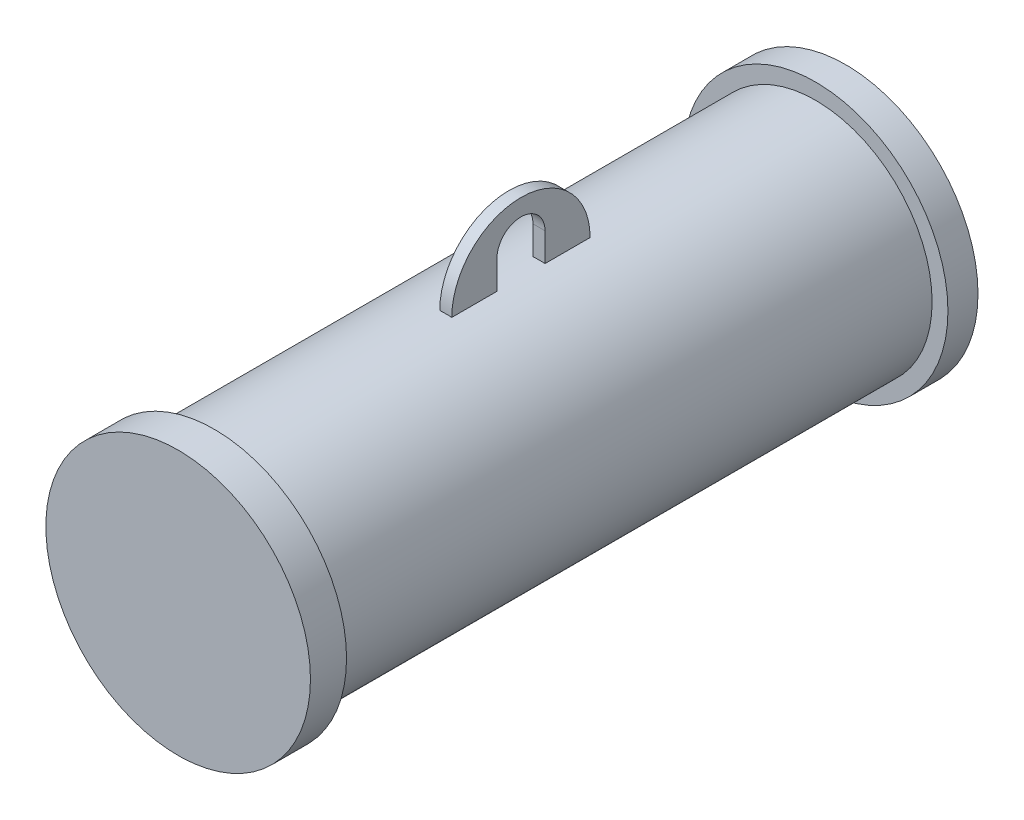
ISO-10303-21;
HEADER;
FILE_DESCRIPTION(('STEP AP214'),'2;1');
FILE_NAME('part.step','',(''),(''),'','','');
FILE_SCHEMA(('AUTOMOTIVE_DESIGN { 1 0 10303 214 1 1 1 1 }'));
ENDSEC;
DATA;
#1=APPLICATION_CONTEXT('core data for automotive mechanical design processes');
#2=APPLICATION_PROTOCOL_DEFINITION('international standard','automotive_design',2000,#1);
#3=PRODUCT_CONTEXT('',#1,'mechanical');
#4=PRODUCT('Part','Part','',(#3));
#5=PRODUCT_RELATED_PRODUCT_CATEGORY('part','',(#4));
#6=PRODUCT_DEFINITION_FORMATION('','',#4);
#7=PRODUCT_DEFINITION_CONTEXT('part definition',#1,'design');
#8=PRODUCT_DEFINITION('design','',#6,#7);
#9=PRODUCT_DEFINITION_SHAPE('','',#8);
#10=(LENGTH_UNIT() NAMED_UNIT(*) SI_UNIT(.MILLI.,.METRE.));
#11=(NAMED_UNIT(*) PLANE_ANGLE_UNIT() SI_UNIT($,.RADIAN.));
#12=(NAMED_UNIT(*) SI_UNIT($,.STERADIAN.) SOLID_ANGLE_UNIT());
#13=UNCERTAINTY_MEASURE_WITH_UNIT(LENGTH_MEASURE(1.E-05),#10,'distance_accuracy_value','');
#14=(GEOMETRIC_REPRESENTATION_CONTEXT(3) GLOBAL_UNCERTAINTY_ASSIGNED_CONTEXT((#13)) GLOBAL_UNIT_ASSIGNED_CONTEXT((#10,
#11,#12)) REPRESENTATION_CONTEXT('',''));
#15=CARTESIAN_POINT('',(0.,0.,0.));
#16=DIRECTION('',(0.,0.,1.));
#17=DIRECTION('',(1.,0.,0.));
#18=AXIS2_PLACEMENT_3D('',#15,#16,#17);
#19=CARTESIAN_POINT('',(0.,0.,0.));
#20=DIRECTION('',(0.,0.,1.));
#21=DIRECTION('',(1.,0.,0.));
#22=AXIS2_PLACEMENT_3D('',#19,#20,#21);
#23=PLANE('',#22);
#24=CARTESIAN_POINT('',(0.,0.,0.));
#25=DIRECTION('',(0.,0.,1.));
#26=DIRECTION('',(1.,0.,0.));
#27=AXIS2_PLACEMENT_3D('',#24,#25,#26);
#28=CIRCLE('',#27,110.);
#29=CARTESIAN_POINT('',(110.,0.,0.));
#30=VERTEX_POINT('',#29);
#31=EDGE_CURVE('E20',#30,#30,#28,.T.);
#32=ORIENTED_EDGE('',*,*,#31,.T.);
#33=EDGE_LOOP('',(#32));
#34=FACE_BOUND('',#33,.T.);
#35=ADVANCED_FACE('F16',(#34),#23,.T.);
#36=CARTESIAN_POINT('',(0.,0.,-30.));
#37=DIRECTION('',(0.,0.,1.));
#38=DIRECTION('',(1.,0.,0.));
#39=AXIS2_PLACEMENT_3D('',#36,#37,#38);
#40=CYLINDRICAL_SURFACE('',#39,110.);
#41=CARTESIAN_POINT('',(0.,0.,-30.));
#42=DIRECTION('',(0.,0.,1.));
#43=DIRECTION('',(1.,0.,0.));
#44=AXIS2_PLACEMENT_3D('',#41,#42,#43);
#45=CIRCLE('',#44,110.);
#46=CARTESIAN_POINT('',(110.,0.,-30.));
#47=VERTEX_POINT('',#46);
#48=EDGE_CURVE('E10',#47,#47,#45,.T.);
#49=ORIENTED_EDGE('',*,*,#48,.T.);
#50=EDGE_LOOP('',(#49));
#51=FACE_BOUND('',#50,.T.);
#52=ORIENTED_EDGE('',*,*,#31,.F.);
#53=EDGE_LOOP('',(#52));
#54=FACE_BOUND('',#53,.T.);
#55=ADVANCED_FACE('F18',(#51,#54),#40,.T.);
#56=CARTESIAN_POINT('',(0.,0.,-30.));
#57=DIRECTION('',(0.,0.,1.));
#58=DIRECTION('',(1.,0.,0.));
#59=AXIS2_PLACEMENT_3D('',#56,#57,#58);
#60=PLANE('',#59);
#61=CARTESIAN_POINT('',(0.,0.,-30.));
#62=DIRECTION('',(0.,0.,1.));
#63=DIRECTION('',(1.,0.,0.));
#64=AXIS2_PLACEMENT_3D('',#61,#62,#63);
#65=CIRCLE('',#64,96.85);
#66=CARTESIAN_POINT('',(96.85,0.,-30.));
#67=VERTEX_POINT('',#66);
#68=EDGE_CURVE('E166',#67,#67,#65,.T.);
#69=ORIENTED_EDGE('',*,*,#68,.T.);
#70=EDGE_LOOP('',(#69));
#71=FACE_BOUND('',#70,.T.);
#72=ORIENTED_EDGE('',*,*,#48,.F.);
#73=EDGE_LOOP('',(#72));
#74=FACE_BOUND('',#73,.T.);
#75=ADVANCED_FACE('F256',(#71,#74),#60,.F.);
#76=CARTESIAN_POINT('',(0.,0.,-30.));
#77=DIRECTION('',(0.,0.,-1.));
#78=DIRECTION('',(-1.,0.,0.));
#79=AXIS2_PLACEMENT_3D('',#76,#77,#78);
#80=CYLINDRICAL_SURFACE('',#79,96.85);
#81=CARTESIAN_POINT('',(0.,0.,-260.));
#82=DIRECTION('',(0.,0.,1.));
#83=DIRECTION('',(0.,-1.,0.));
#84=AXIS2_PLACEMENT_3D('',#81,#82,#83);
#85=CIRCLE('',#84,96.85);
#86=CARTESIAN_POINT('',(5.,96.7208483213418,-260.));
#87=VERTEX_POINT('',#86);
#88=CARTESIAN_POINT('',(-5.,96.7208483213418,-260.));
#89=VERTEX_POINT('',#88);
#90=EDGE_CURVE('E188',#87,#89,#85,.T.);
#91=ORIENTED_EDGE('',*,*,#90,.F.);
#92=DIRECTION('',(0.,0.,-1.));
#93=VECTOR('',#92,1.);
#94=CARTESIAN_POINT('',(5.,96.7208483213418,-30.));
#95=LINE('',#94,#93);
#96=CARTESIAN_POINT('',(5.,96.7208483213418,-222.5));
#97=VERTEX_POINT('',#96);
#98=EDGE_CURVE('E184',#87,#97,#95,.F.);
#99=ORIENTED_EDGE('',*,*,#98,.T.);
#100=CARTESIAN_POINT('',(0.,0.,-222.5));
#101=DIRECTION('',(0.,0.,-1.));
#102=DIRECTION('',(-1.,0.,0.));
#103=AXIS2_PLACEMENT_3D('',#100,#101,#102);
#104=CIRCLE('',#103,96.85);
#105=CARTESIAN_POINT('',(0.,96.85,-222.5));
#106=VERTEX_POINT('',#105);
#107=EDGE_CURVE('E170',#106,#97,#104,.T.);
#108=ORIENTED_EDGE('',*,*,#107,.F.);
#109=CARTESIAN_POINT('',(-5.,96.7208483213418,-222.5));
#110=VERTEX_POINT('',#109);
#111=EDGE_CURVE('E180',#110,#106,#104,.T.);
#112=ORIENTED_EDGE('',*,*,#111,.F.);
#113=DIRECTION('',(0.,0.,-1.));
#114=VECTOR('',#113,1.);
#115=CARTESIAN_POINT('',(-5.,96.7208483213418,-30.));
#116=LINE('',#115,#114);
#117=EDGE_CURVE('E181',#89,#110,#116,.F.);
#118=ORIENTED_EDGE('',*,*,#117,.F.);
#119=EDGE_LOOP('',(#91,#99,#108,#112,#118));
#120=FACE_BOUND('',#119,.T.);
#121=ORIENTED_EDGE('',*,*,#68,.F.);
#122=EDGE_LOOP('',(#121));
#123=FACE_BOUND('',#122,.T.);
#124=CARTESIAN_POINT('',(0.,0.,-530.));
#125=DIRECTION('',(0.,0.,1.));
#126=DIRECTION('',(1.,0.,0.));
#127=AXIS2_PLACEMENT_3D('',#124,#125,#126);
#128=CIRCLE('',#127,96.85);
#129=CARTESIAN_POINT('',(96.85,0.,-530.));
#130=VERTEX_POINT('',#129);
#131=EDGE_CURVE('E171',#130,#130,#128,.T.);
#132=ORIENTED_EDGE('',*,*,#131,.T.);
#133=EDGE_LOOP('',(#132));
#134=FACE_BOUND('',#133,.T.);
#135=CARTESIAN_POINT('',(0.,0.,-300.));
#136=DIRECTION('',(0.,0.,-1.));
#137=DIRECTION('',(0.,1.,0.));
#138=AXIS2_PLACEMENT_3D('',#135,#136,#137);
#139=CIRCLE('',#138,96.85);
#140=CARTESIAN_POINT('',(-5.,96.7208483213418,-300.));
#141=VERTEX_POINT('',#140);
#142=CARTESIAN_POINT('',(5.,96.7208483213418,-300.));
#143=VERTEX_POINT('',#142);
#144=EDGE_CURVE('E43',#141,#143,#139,.T.);
#145=ORIENTED_EDGE('',*,*,#144,.F.);
#146=CARTESIAN_POINT('',(-5.,96.7208483213418,-337.5));
#147=VERTEX_POINT('',#146);
#148=EDGE_CURVE('E185',#147,#141,#116,.F.);
#149=ORIENTED_EDGE('',*,*,#148,.F.);
#150=CARTESIAN_POINT('',(0.,0.,-337.5));
#151=DIRECTION('',(0.,0.,1.));
#152=DIRECTION('',(1.,0.,0.));
#153=AXIS2_PLACEMENT_3D('',#150,#151,#152);
#154=CIRCLE('',#153,96.85);
#155=CARTESIAN_POINT('',(0.,96.85,-337.5));
#156=VERTEX_POINT('',#155);
#157=EDGE_CURVE('E115',#156,#147,#154,.T.);
#158=ORIENTED_EDGE('',*,*,#157,.F.);
#159=CARTESIAN_POINT('',(5.,96.7208483213418,-337.5));
#160=VERTEX_POINT('',#159);
#161=EDGE_CURVE('E194',#160,#156,#154,.T.);
#162=ORIENTED_EDGE('',*,*,#161,.F.);
#163=EDGE_CURVE('E37',#160,#143,#95,.F.);
#164=ORIENTED_EDGE('',*,*,#163,.T.);
#165=EDGE_LOOP('',(#145,#149,#158,#162,#164));
#166=FACE_BOUND('',#165,.T.);
#167=ADVANCED_FACE('F213',(#120,#123,#134,#166),#80,.T.);
#168=CARTESIAN_POINT('',(5.,120.35,-280.));
#169=DIRECTION('',(1.,0.,0.));
#170=DIRECTION('',(0.,1.,0.));
#171=AXIS2_PLACEMENT_3D('',#168,#169,#170);
#172=PLANE('',#171);
#173=ORIENTED_EDGE('',*,*,#163,.F.);
#174=DIRECTION('',(0.,1.,0.));
#175=VECTOR('',#174,1.);
#176=CARTESIAN_POINT('',(5.,86.85,-337.5));
#177=LINE('',#176,#175);
#178=CARTESIAN_POINT('',(5.,96.85,-337.5));
#179=VERTEX_POINT('',#178);
#180=EDGE_CURVE('E120',#160,#179,#177,.T.);
#181=ORIENTED_EDGE('',*,*,#180,.T.);
#182=CARTESIAN_POINT('',(5.,96.8500000000001,-280.));
#183=DIRECTION('',(1.,0.,0.));
#184=DIRECTION('',(0.,1.,0.));
#185=AXIS2_PLACEMENT_3D('',#182,#183,#184);
#186=CIRCLE('',#185,57.5);
#187=CARTESIAN_POINT('',(5.,96.85,-222.5));
#188=VERTEX_POINT('',#187);
#189=EDGE_CURVE('E221',#179,#188,#186,.T.);
#190=ORIENTED_EDGE('',*,*,#189,.T.);
#191=DIRECTION('',(0.,1.,0.));
#192=VECTOR('',#191,1.);
#193=CARTESIAN_POINT('',(5.,86.85,-222.5));
#194=LINE('',#193,#192);
#195=EDGE_CURVE('E175',#97,#188,#194,.T.);
#196=ORIENTED_EDGE('',*,*,#195,.F.);
#197=ORIENTED_EDGE('',*,*,#98,.F.);
#198=DIRECTION('',(0.,1.,0.));
#199=VECTOR('',#198,1.);
#200=CARTESIAN_POINT('',(5.,96.85,-260.));
#201=LINE('',#200,#199);
#202=CARTESIAN_POINT('',(5.,120.35,-260.));
#203=VERTEX_POINT('',#202);
#204=EDGE_CURVE('E139',#87,#203,#201,.T.);
#205=ORIENTED_EDGE('',*,*,#204,.T.);
#206=CARTESIAN_POINT('',(5.,120.35,-280.));
#207=DIRECTION('',(-1.,0.,0.));
#208=DIRECTION('',(0.,1.,0.));
#209=AXIS2_PLACEMENT_3D('',#206,#207,#208);
#210=CIRCLE('',#209,20.);
#211=CARTESIAN_POINT('',(5.,120.35,-300.));
#212=VERTEX_POINT('',#211);
#213=EDGE_CURVE('E146',#203,#212,#210,.T.);
#214=ORIENTED_EDGE('',*,*,#213,.T.);
#215=DIRECTION('',(0.,-1.,0.));
#216=VECTOR('',#215,1.);
#217=CARTESIAN_POINT('',(5.,96.85,-300.));
#218=LINE('',#217,#216);
#219=EDGE_CURVE('E217',#212,#143,#218,.T.);
#220=ORIENTED_EDGE('',*,*,#219,.T.);
#221=EDGE_LOOP('',(#173,#181,#190,#196,#197,#205,#214,#220));
#222=FACE_BOUND('',#221,.T.);
#223=ADVANCED_FACE('F215',(#222),#172,.T.);
#224=CARTESIAN_POINT('',(-5.,120.35,-280.));
#225=DIRECTION('',(1.,0.,0.));
#226=DIRECTION('',(0.,1.,0.));
#227=AXIS2_PLACEMENT_3D('',#224,#225,#226);
#228=PLANE('',#227);
#229=DIRECTION('',(0.,1.,0.));
#230=VECTOR('',#229,1.);
#231=CARTESIAN_POINT('',(-5.,86.85,-337.5));
#232=LINE('',#231,#230);
#233=CARTESIAN_POINT('',(-5.,96.85,-337.5));
#234=VERTEX_POINT('',#233);
#235=EDGE_CURVE('E110',#147,#234,#232,.T.);
#236=ORIENTED_EDGE('',*,*,#235,.F.);
#237=ORIENTED_EDGE('',*,*,#148,.T.);
#238=DIRECTION('',(0.,-1.,0.));
#239=VECTOR('',#238,1.);
#240=CARTESIAN_POINT('',(-5.,96.85,-300.));
#241=LINE('',#240,#239);
#242=CARTESIAN_POINT('',(-5.,120.35,-300.));
#243=VERTEX_POINT('',#242);
#244=EDGE_CURVE('E140',#243,#141,#241,.T.);
#245=ORIENTED_EDGE('',*,*,#244,.F.);
#246=CARTESIAN_POINT('',(-5.,120.35,-280.));
#247=DIRECTION('',(-1.,0.,0.));
#248=DIRECTION('',(0.,1.,0.));
#249=AXIS2_PLACEMENT_3D('',#246,#247,#248);
#250=CIRCLE('',#249,20.);
#251=CARTESIAN_POINT('',(-5.,120.35,-260.));
#252=VERTEX_POINT('',#251);
#253=EDGE_CURVE('E149',#252,#243,#250,.T.);
#254=ORIENTED_EDGE('',*,*,#253,.F.);
#255=DIRECTION('',(0.,1.,0.));
#256=VECTOR('',#255,1.);
#257=CARTESIAN_POINT('',(-5.,96.85,-260.));
#258=LINE('',#257,#256);
#259=EDGE_CURVE('E119',#89,#252,#258,.T.);
#260=ORIENTED_EDGE('',*,*,#259,.F.);
#261=ORIENTED_EDGE('',*,*,#117,.T.);
#262=DIRECTION('',(0.,1.,0.));
#263=VECTOR('',#262,1.);
#264=CARTESIAN_POINT('',(-5.,86.85,-222.5));
#265=LINE('',#264,#263);
#266=CARTESIAN_POINT('',(-5.,96.85,-222.5));
#267=VERTEX_POINT('',#266);
#268=EDGE_CURVE('E136',#110,#267,#265,.T.);
#269=ORIENTED_EDGE('',*,*,#268,.T.);
#270=CARTESIAN_POINT('',(-5.,96.8500000000001,-280.));
#271=DIRECTION('',(1.,0.,0.));
#272=DIRECTION('',(0.,1.,0.));
#273=AXIS2_PLACEMENT_3D('',#270,#271,#272);
#274=CIRCLE('',#273,57.5);
#275=EDGE_CURVE('E126',#234,#267,#274,.T.);
#276=ORIENTED_EDGE('',*,*,#275,.F.);
#277=EDGE_LOOP('',(#236,#237,#245,#254,#260,#261,#269,#276));
#278=FACE_BOUND('',#277,.T.);
#279=ADVANCED_FACE('F133',(#278),#228,.F.);
#280=CARTESIAN_POINT('',(-5.,86.85,-337.5));
#281=DIRECTION('',(0.,0.,1.));
#282=DIRECTION('',(1.,0.,0.));
#283=AXIS2_PLACEMENT_3D('',#280,#281,#282);
#284=PLANE('',#283);
#285=ORIENTED_EDGE('',*,*,#180,.F.);
#286=ORIENTED_EDGE('',*,*,#161,.T.);
#287=DIRECTION('',(-1.,0.,0.));
#288=VECTOR('',#287,1.);
#289=CARTESIAN_POINT('',(5.,96.85,-337.5));
#290=LINE('',#289,#288);
#291=EDGE_CURVE('E129',#179,#156,#290,.T.);
#292=ORIENTED_EDGE('',*,*,#291,.F.);
#293=EDGE_LOOP('',(#285,#286,#292));
#294=FACE_BOUND('',#293,.T.);
#295=ADVANCED_FACE('F212',(#294),#284,.F.);
#296=CARTESIAN_POINT('',(5.,86.85,-222.5));
#297=DIRECTION('',(0.,0.,-1.));
#298=DIRECTION('',(-1.,0.,0.));
#299=AXIS2_PLACEMENT_3D('',#296,#297,#298);
#300=PLANE('',#299);
#301=ORIENTED_EDGE('',*,*,#268,.F.);
#302=ORIENTED_EDGE('',*,*,#111,.T.);
#303=DIRECTION('',(-1.,0.,0.));
#304=VECTOR('',#303,1.);
#305=CARTESIAN_POINT('',(5.,96.85,-222.5));
#306=LINE('',#305,#304);
#307=EDGE_CURVE('E155',#106,#267,#306,.T.);
#308=ORIENTED_EDGE('',*,*,#307,.T.);
#309=EDGE_LOOP('',(#301,#302,#308));
#310=FACE_BOUND('',#309,.T.);
#311=ADVANCED_FACE('F266',(#310),#300,.F.);
#312=CARTESIAN_POINT('',(5.,96.85,-260.));
#313=DIRECTION('',(0.,0.,1.));
#314=DIRECTION('',(0.,-1.,0.));
#315=AXIS2_PLACEMENT_3D('',#312,#313,#314);
#316=PLANE('',#315);
#317=ORIENTED_EDGE('',*,*,#204,.F.);
#318=ORIENTED_EDGE('',*,*,#90,.T.);
#319=ORIENTED_EDGE('',*,*,#259,.T.);
#320=DIRECTION('',(-1.,0.,0.));
#321=VECTOR('',#320,1.);
#322=CARTESIAN_POINT('',(5.,120.35,-260.));
#323=LINE('',#322,#321);
#324=EDGE_CURVE('E162',#203,#252,#323,.T.);
#325=ORIENTED_EDGE('',*,*,#324,.F.);
#326=EDGE_LOOP('',(#317,#318,#319,#325));
#327=FACE_BOUND('',#326,.T.);
#328=ADVANCED_FACE('F248',(#327),#316,.F.);
#329=CARTESIAN_POINT('',(5.,120.35,-280.));
#330=DIRECTION('',(-1.,0.,0.));
#331=DIRECTION('',(0.,-1.,0.));
#332=AXIS2_PLACEMENT_3D('',#329,#330,#331);
#333=CYLINDRICAL_SURFACE('',#332,20.);
#334=ORIENTED_EDGE('',*,*,#253,.T.);
#335=DIRECTION('',(-1.,0.,0.));
#336=VECTOR('',#335,1.);
#337=CARTESIAN_POINT('',(5.,120.35,-300.));
#338=LINE('',#337,#336);
#339=EDGE_CURVE('E158',#212,#243,#338,.T.);
#340=ORIENTED_EDGE('',*,*,#339,.F.);
#341=ORIENTED_EDGE('',*,*,#213,.F.);
#342=ORIENTED_EDGE('',*,*,#324,.T.);
#343=EDGE_LOOP('',(#334,#340,#341,#342));
#344=FACE_BOUND('',#343,.T.);
#345=ADVANCED_FACE('F234',(#344),#333,.F.);
#346=CARTESIAN_POINT('',(5.,96.85,-300.));
#347=DIRECTION('',(0.,0.,-1.));
#348=DIRECTION('',(0.,1.,0.));
#349=AXIS2_PLACEMENT_3D('',#346,#347,#348);
#350=PLANE('',#349);
#351=ORIENTED_EDGE('',*,*,#244,.T.);
#352=ORIENTED_EDGE('',*,*,#144,.T.);
#353=ORIENTED_EDGE('',*,*,#219,.F.);
#354=ORIENTED_EDGE('',*,*,#339,.T.);
#355=EDGE_LOOP('',(#351,#352,#353,#354));
#356=FACE_BOUND('',#355,.T.);
#357=ADVANCED_FACE('F237',(#356),#350,.F.);
#358=CARTESIAN_POINT('',(5.,96.8500000000001,-280.));
#359=DIRECTION('',(-1.,0.,0.));
#360=DIRECTION('',(0.,-1.,0.));
#361=AXIS2_PLACEMENT_3D('',#358,#359,#360);
#362=CYLINDRICAL_SURFACE('',#361,57.5);
#363=ORIENTED_EDGE('',*,*,#275,.T.);
#364=ORIENTED_EDGE('',*,*,#307,.F.);
#365=EDGE_CURVE('E131',#188,#106,#306,.T.);
#366=ORIENTED_EDGE('',*,*,#365,.F.);
#367=ORIENTED_EDGE('',*,*,#189,.F.);
#368=ORIENTED_EDGE('',*,*,#291,.T.);
#369=EDGE_CURVE('E113',#156,#234,#290,.T.);
#370=ORIENTED_EDGE('',*,*,#369,.T.);
#371=EDGE_LOOP('',(#363,#364,#366,#367,#368,#370));
#372=FACE_BOUND('',#371,.T.);
#373=ADVANCED_FACE('F124',(#372),#362,.T.);
#374=ORIENTED_EDGE('',*,*,#369,.F.);
#375=ORIENTED_EDGE('',*,*,#157,.T.);
#376=ORIENTED_EDGE('',*,*,#235,.T.);
#377=EDGE_LOOP('',(#374,#375,#376));
#378=FACE_BOUND('',#377,.T.);
#379=ADVANCED_FACE('F112',(#378),#284,.F.);
#380=ORIENTED_EDGE('',*,*,#365,.T.);
#381=ORIENTED_EDGE('',*,*,#107,.T.);
#382=ORIENTED_EDGE('',*,*,#195,.T.);
#383=EDGE_LOOP('',(#380,#381,#382));
#384=FACE_BOUND('',#383,.T.);
#385=ADVANCED_FACE('F275',(#384),#300,.F.);
#386=CARTESIAN_POINT('',(0.,51.,-530.));
#387=DIRECTION('',(0.,0.,-1.));
#388=DIRECTION('',(-1.,0.,0.));
#389=AXIS2_PLACEMENT_3D('',#386,#387,#388);
#390=PLANE('',#389);
#391=ORIENTED_EDGE('',*,*,#131,.F.);
#392=EDGE_LOOP('',(#391));
#393=FACE_BOUND('',#392,.T.);
#394=CARTESIAN_POINT('',(0.,0.,-530.));
#395=DIRECTION('',(0.,0.,1.));
#396=DIRECTION('',(1.,0.,0.));
#397=AXIS2_PLACEMENT_3D('',#394,#395,#396);
#398=CIRCLE('',#397,110.);
#399=CARTESIAN_POINT('',(110.,0.,-530.));
#400=VERTEX_POINT('',#399);
#401=EDGE_CURVE('E176',#400,#400,#398,.T.);
#402=ORIENTED_EDGE('',*,*,#401,.T.);
#403=EDGE_LOOP('',(#402));
#404=FACE_BOUND('',#403,.T.);
#405=ADVANCED_FACE('F379',(#393,#404),#390,.F.);
#406=CARTESIAN_POINT('',(0.,0.,-530.));
#407=DIRECTION('',(0.,0.,1.));
#408=DIRECTION('',(1.,0.,0.));
#409=AXIS2_PLACEMENT_3D('',#406,#407,#408);
#410=CYLINDRICAL_SURFACE('',#409,110.);
#411=ORIENTED_EDGE('',*,*,#401,.F.);
#412=EDGE_LOOP('',(#411));
#413=FACE_BOUND('',#412,.T.);
#414=CARTESIAN_POINT('',(0.,0.,-555.));
#415=DIRECTION('',(0.,0.,1.));
#416=DIRECTION('',(1.,0.,0.));
#417=AXIS2_PLACEMENT_3D('',#414,#415,#416);
#418=CIRCLE('',#417,110.);
#419=CARTESIAN_POINT('',(110.,0.,-555.));
#420=VERTEX_POINT('',#419);
#421=EDGE_CURVE('E339',#420,#420,#418,.T.);
#422=ORIENTED_EDGE('',*,*,#421,.T.);
#423=EDGE_LOOP('',(#422));
#424=FACE_BOUND('',#423,.T.);
#425=ADVANCED_FACE('F375',(#413,#424),#410,.T.);
#426=CARTESIAN_POINT('',(0.,110.,-555.));
#427=DIRECTION('',(0.,0.,1.));
#428=DIRECTION('',(1.,0.,0.));
#429=AXIS2_PLACEMENT_3D('',#426,#427,#428);
#430=PLANE('',#429);
#431=ORIENTED_EDGE('',*,*,#421,.F.);
#432=EDGE_LOOP('',(#431));
#433=FACE_BOUND('',#432,.T.);
#434=CARTESIAN_POINT('',(0.,0.,-555.));
#435=DIRECTION('',(0.,0.,1.));
#436=DIRECTION('',(1.,0.,0.));
#437=AXIS2_PLACEMENT_3D('',#434,#435,#436);
#438=CIRCLE('',#437,71.5);
#439=CARTESIAN_POINT('',(71.5,0.,-555.));
#440=VERTEX_POINT('',#439);
#441=EDGE_CURVE('E346',#440,#440,#438,.T.);
#442=ORIENTED_EDGE('',*,*,#441,.T.);
#443=EDGE_LOOP('',(#442));
#444=FACE_BOUND('',#443,.T.);
#445=ADVANCED_FACE('F369',(#433,#444),#430,.F.);
#446=CARTESIAN_POINT('',(0.,0.,-560.));
#447=DIRECTION('',(0.,0.,1.));
#448=DIRECTION('',(1.,0.,0.));
#449=AXIS2_PLACEMENT_3D('',#446,#447,#448);
#450=CONICAL_SURFACE('',#449,66.5,0.78539816339745);
#451=ORIENTED_EDGE('',*,*,#441,.F.);
#452=EDGE_LOOP('',(#451));
#453=FACE_BOUND('',#452,.T.);
#454=CARTESIAN_POINT('',(0.,0.,-560.));
#455=DIRECTION('',(0.,0.,1.));
#456=DIRECTION('',(1.,0.,0.));
#457=AXIS2_PLACEMENT_3D('',#454,#455,#456);
#458=CIRCLE('',#457,66.5);
#459=CARTESIAN_POINT('',(66.5,0.,-560.));
#460=VERTEX_POINT('',#459);
#461=EDGE_CURVE('E353',#460,#460,#458,.T.);
#462=ORIENTED_EDGE('',*,*,#461,.T.);
#463=EDGE_LOOP('',(#462));
#464=FACE_BOUND('',#463,.T.);
#465=ADVANCED_FACE('F364',(#453,#464),#450,.T.);
#466=CARTESIAN_POINT('',(0.,66.5,-560.));
#467=DIRECTION('',(0.,0.,1.));
#468=DIRECTION('',(1.,0.,0.));
#469=AXIS2_PLACEMENT_3D('',#466,#467,#468);
#470=PLANE('',#469);
#471=ORIENTED_EDGE('',*,*,#461,.F.);
#472=EDGE_LOOP('',(#471));
#473=FACE_BOUND('',#472,.T.);
#474=ADVANCED_FACE('F366',(#473),#470,.F.);
#475=CLOSED_SHELL('',(#35,#55,#75,#167,#223,#279,#295,#311,#328,#345,#357,#373,#379,#385,#405,
#425,#445,#465,#474));
#476=MANIFOLD_SOLID_BREP('B1',#475);
#477=ADVANCED_BREP_SHAPE_REPRESENTATION('',(#18,#476),#14);
#478=SHAPE_DEFINITION_REPRESENTATION(#9,#477);
ENDSEC;
END-ISO-10303-21;
